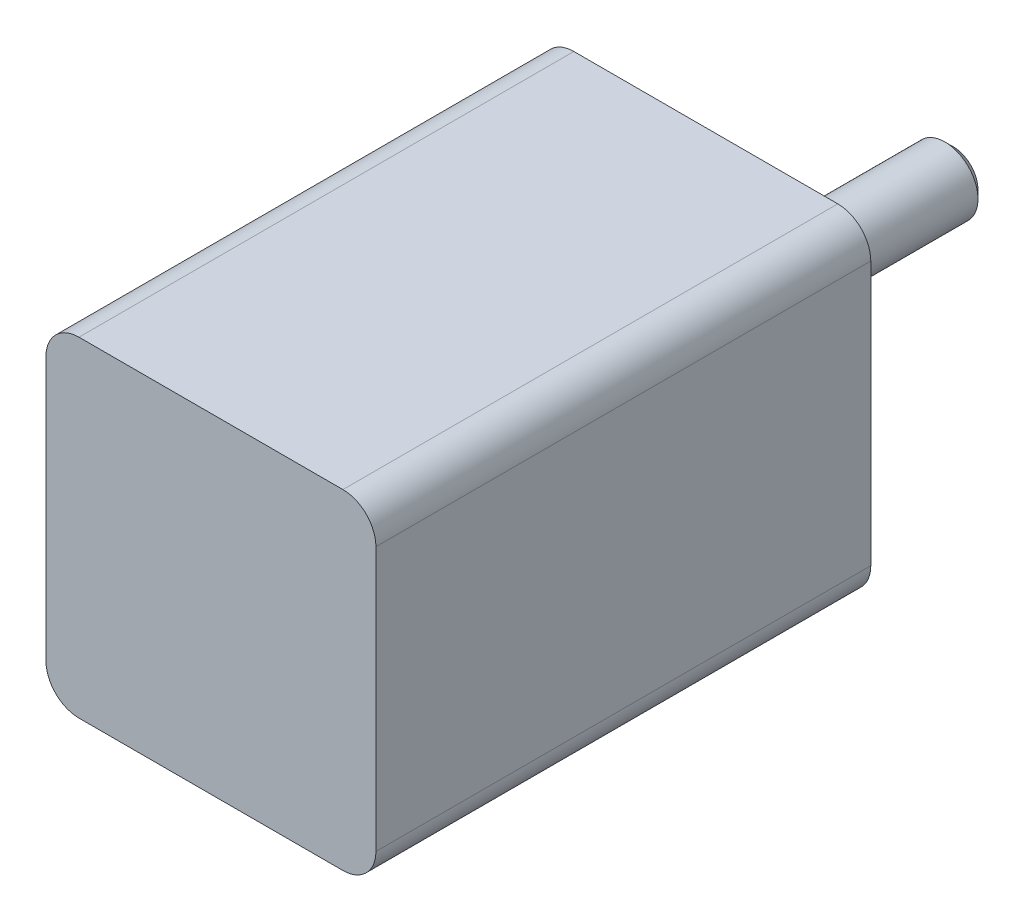
ISO-10303-21;
HEADER;
FILE_DESCRIPTION(('STEP AP214'),'2;1');
FILE_NAME('part.step','',(''),(''),'','','');
FILE_SCHEMA(('AUTOMOTIVE_DESIGN { 1 0 10303 214 1 1 1 1 }'));
ENDSEC;
DATA;
#1=APPLICATION_CONTEXT('core data for automotive mechanical design processes');
#2=APPLICATION_PROTOCOL_DEFINITION('international standard','automotive_design',2000,#1);
#3=PRODUCT_CONTEXT('',#1,'mechanical');
#4=PRODUCT('Part','Part','',(#3));
#5=PRODUCT_RELATED_PRODUCT_CATEGORY('part','',(#4));
#6=PRODUCT_DEFINITION_FORMATION('','',#4);
#7=PRODUCT_DEFINITION_CONTEXT('part definition',#1,'design');
#8=PRODUCT_DEFINITION('design','',#6,#7);
#9=PRODUCT_DEFINITION_SHAPE('','',#8);
#10=(LENGTH_UNIT() NAMED_UNIT(*) SI_UNIT(.MILLI.,.METRE.));
#11=(NAMED_UNIT(*) PLANE_ANGLE_UNIT() SI_UNIT($,.RADIAN.));
#12=(NAMED_UNIT(*) SI_UNIT($,.STERADIAN.) SOLID_ANGLE_UNIT());
#13=UNCERTAINTY_MEASURE_WITH_UNIT(LENGTH_MEASURE(1.E-05),#10,'distance_accuracy_value','');
#14=(GEOMETRIC_REPRESENTATION_CONTEXT(3) GLOBAL_UNCERTAINTY_ASSIGNED_CONTEXT((#13)) GLOBAL_UNIT_ASSIGNED_CONTEXT((#10,
#11,#12)) REPRESENTATION_CONTEXT('',''));
#15=CARTESIAN_POINT('',(0.,0.,0.));
#16=DIRECTION('',(0.,0.,1.));
#17=DIRECTION('',(1.,0.,0.));
#18=AXIS2_PLACEMENT_3D('',#15,#16,#17);
#19=CARTESIAN_POINT('',(10.,10.,30.));
#20=DIRECTION('',(-1.,0.,0.));
#21=DIRECTION('',(0.,-1.,0.));
#22=AXIS2_PLACEMENT_3D('',#19,#20,#21);
#23=PLANE('',#22);
#24=DIRECTION('',(0.,1.,0.));
#25=VECTOR('',#24,1.);
#26=CARTESIAN_POINT('',(10.,10.,30.));
#27=LINE('',#26,#25);
#28=CARTESIAN_POINT('',(10.,-8.,30.));
#29=VERTEX_POINT('',#28);
#30=CARTESIAN_POINT('',(10.,8.,30.));
#31=VERTEX_POINT('',#30);
#32=EDGE_CURVE('E156',#29,#31,#27,.T.);
#33=ORIENTED_EDGE('',*,*,#32,.F.);
#34=DIRECTION('',(0.,0.,-1.));
#35=VECTOR('',#34,1.);
#36=CARTESIAN_POINT('',(10.,-8.,30.));
#37=LINE('',#36,#35);
#38=CARTESIAN_POINT('',(10.,-8.,0.));
#39=VERTEX_POINT('',#38);
#40=EDGE_CURVE('E206',#29,#39,#37,.T.);
#41=ORIENTED_EDGE('',*,*,#40,.T.);
#42=DIRECTION('',(0.,1.,0.));
#43=VECTOR('',#42,1.);
#44=CARTESIAN_POINT('',(10.,10.,0.));
#45=LINE('',#44,#43);
#46=CARTESIAN_POINT('',(10.,8.,0.));
#47=VERTEX_POINT('',#46);
#48=EDGE_CURVE('E155',#39,#47,#45,.T.);
#49=ORIENTED_EDGE('',*,*,#48,.T.);
#50=DIRECTION('',(0.,0.,-1.));
#51=VECTOR('',#50,1.);
#52=CARTESIAN_POINT('',(10.,8.,30.));
#53=LINE('',#52,#51);
#54=EDGE_CURVE('E204',#47,#31,#53,.F.);
#55=ORIENTED_EDGE('',*,*,#54,.T.);
#56=EDGE_LOOP('',(#33,#41,#49,#55));
#57=FACE_BOUND('',#56,.T.);
#58=ADVANCED_FACE('F39',(#57),#23,.F.);
#59=CARTESIAN_POINT('',(-10.,10.,30.));
#60=DIRECTION('',(0.,-1.,0.));
#61=DIRECTION('',(0.,0.,-1.));
#62=AXIS2_PLACEMENT_3D('',#59,#60,#61);
#63=PLANE('',#62);
#64=DIRECTION('',(-1.,0.,0.));
#65=VECTOR('',#64,1.);
#66=CARTESIAN_POINT('',(-10.,10.,0.));
#67=LINE('',#66,#65);
#68=CARTESIAN_POINT('',(8.,10.,0.));
#69=VERTEX_POINT('',#68);
#70=CARTESIAN_POINT('',(-8.00000000000001,10.,0.));
#71=VERTEX_POINT('',#70);
#72=EDGE_CURVE('E170',#69,#71,#67,.T.);
#73=ORIENTED_EDGE('',*,*,#72,.T.);
#74=DIRECTION('',(0.,0.,-1.));
#75=VECTOR('',#74,1.);
#76=CARTESIAN_POINT('',(-8.00000000000001,10.,30.));
#77=LINE('',#76,#75);
#78=CARTESIAN_POINT('',(-8.00000000000001,10.,30.));
#79=VERTEX_POINT('',#78);
#80=EDGE_CURVE('E54',#71,#79,#77,.F.);
#81=ORIENTED_EDGE('',*,*,#80,.T.);
#82=DIRECTION('',(-1.,0.,0.));
#83=VECTOR('',#82,1.);
#84=CARTESIAN_POINT('',(-10.,10.,30.));
#85=LINE('',#84,#83);
#86=CARTESIAN_POINT('',(8.,10.,30.));
#87=VERTEX_POINT('',#86);
#88=EDGE_CURVE('E158',#87,#79,#85,.T.);
#89=ORIENTED_EDGE('',*,*,#88,.F.);
#90=DIRECTION('',(0.,0.,-1.));
#91=VECTOR('',#90,1.);
#92=CARTESIAN_POINT('',(8.,10.,30.));
#93=LINE('',#92,#91);
#94=EDGE_CURVE('E209',#87,#69,#93,.T.);
#95=ORIENTED_EDGE('',*,*,#94,.T.);
#96=EDGE_LOOP('',(#73,#81,#89,#95));
#97=FACE_BOUND('',#96,.T.);
#98=ADVANCED_FACE('F227',(#97),#63,.F.);
#99=CARTESIAN_POINT('',(-10.,10.,30.));
#100=DIRECTION('',(1.,0.,0.));
#101=DIRECTION('',(0.,1.,0.));
#102=AXIS2_PLACEMENT_3D('',#99,#100,#101);
#103=PLANE('',#102);
#104=DIRECTION('',(0.,-1.,0.));
#105=VECTOR('',#104,1.);
#106=CARTESIAN_POINT('',(-10.,10.,0.));
#107=LINE('',#106,#105);
#108=CARTESIAN_POINT('',(-10.,8.,0.));
#109=VERTEX_POINT('',#108);
#110=CARTESIAN_POINT('',(-10.,-8.,0.));
#111=VERTEX_POINT('',#110);
#112=EDGE_CURVE('E172',#109,#111,#107,.T.);
#113=ORIENTED_EDGE('',*,*,#112,.T.);
#114=DIRECTION('',(0.,0.,-1.));
#115=VECTOR('',#114,1.);
#116=CARTESIAN_POINT('',(-10.,-8.,30.));
#117=LINE('',#116,#115);
#118=CARTESIAN_POINT('',(-10.,-8.,30.));
#119=VERTEX_POINT('',#118);
#120=EDGE_CURVE('E195',#111,#119,#117,.F.);
#121=ORIENTED_EDGE('',*,*,#120,.T.);
#122=DIRECTION('',(0.,-1.,0.));
#123=VECTOR('',#122,1.);
#124=CARTESIAN_POINT('',(-10.,10.,30.));
#125=LINE('',#124,#123);
#126=CARTESIAN_POINT('',(-10.,8.,30.));
#127=VERTEX_POINT('',#126);
#128=EDGE_CURVE('E161',#127,#119,#125,.T.);
#129=ORIENTED_EDGE('',*,*,#128,.F.);
#130=DIRECTION('',(0.,0.,-1.));
#131=VECTOR('',#130,1.);
#132=CARTESIAN_POINT('',(-10.,8.,30.));
#133=LINE('',#132,#131);
#134=EDGE_CURVE('E192',#127,#109,#133,.T.);
#135=ORIENTED_EDGE('',*,*,#134,.T.);
#136=EDGE_LOOP('',(#113,#121,#129,#135));
#137=FACE_BOUND('',#136,.T.);
#138=ADVANCED_FACE('F233',(#137),#103,.F.);
#139=CARTESIAN_POINT('',(-10.,-10.,30.));
#140=DIRECTION('',(0.,1.,0.));
#141=DIRECTION('',(0.,0.,1.));
#142=AXIS2_PLACEMENT_3D('',#139,#140,#141);
#143=PLANE('',#142);
#144=DIRECTION('',(1.,0.,0.));
#145=VECTOR('',#144,1.);
#146=CARTESIAN_POINT('',(-10.,-10.,30.));
#147=LINE('',#146,#145);
#148=CARTESIAN_POINT('',(-8.,-10.,30.));
#149=VERTEX_POINT('',#148);
#150=CARTESIAN_POINT('',(8.,-10.,30.));
#151=VERTEX_POINT('',#150);
#152=EDGE_CURVE('E164',#149,#151,#147,.T.);
#153=ORIENTED_EDGE('',*,*,#152,.F.);
#154=DIRECTION('',(0.,0.,-1.));
#155=VECTOR('',#154,1.);
#156=CARTESIAN_POINT('',(-8.,-10.,30.));
#157=LINE('',#156,#155);
#158=CARTESIAN_POINT('',(-8.,-10.,0.));
#159=VERTEX_POINT('',#158);
#160=EDGE_CURVE('E181',#149,#159,#157,.T.);
#161=ORIENTED_EDGE('',*,*,#160,.T.);
#162=DIRECTION('',(1.,0.,0.));
#163=VECTOR('',#162,1.);
#164=CARTESIAN_POINT('',(-10.,-10.,0.));
#165=LINE('',#164,#163);
#166=CARTESIAN_POINT('',(8.,-10.,0.));
#167=VERTEX_POINT('',#166);
#168=EDGE_CURVE('E159',#159,#167,#165,.T.);
#169=ORIENTED_EDGE('',*,*,#168,.T.);
#170=DIRECTION('',(0.,0.,-1.));
#171=VECTOR('',#170,1.);
#172=CARTESIAN_POINT('',(8.,-10.,30.));
#173=LINE('',#172,#171);
#174=EDGE_CURVE('E179',#167,#151,#173,.F.);
#175=ORIENTED_EDGE('',*,*,#174,.T.);
#176=EDGE_LOOP('',(#153,#161,#169,#175));
#177=FACE_BOUND('',#176,.T.);
#178=ADVANCED_FACE('F262',(#177),#143,.F.);
#179=CARTESIAN_POINT('',(0.,0.,30.));
#180=DIRECTION('',(0.,0.,1.));
#181=DIRECTION('',(1.,0.,0.));
#182=AXIS2_PLACEMENT_3D('',#179,#180,#181);
#183=PLANE('',#182);
#184=ORIENTED_EDGE('',*,*,#128,.T.);
#185=CARTESIAN_POINT('',(-8.,-8.,30.));
#186=DIRECTION('',(0.,0.,1.));
#187=DIRECTION('',(1.,0.,0.));
#188=AXIS2_PLACEMENT_3D('',#185,#186,#187);
#189=CIRCLE('',#188,2.);
#190=EDGE_CURVE('E202',#119,#149,#189,.T.);
#191=ORIENTED_EDGE('',*,*,#190,.T.);
#192=ORIENTED_EDGE('',*,*,#152,.T.);
#193=CARTESIAN_POINT('',(8.,-8.,30.));
#194=DIRECTION('',(0.,0.,1.));
#195=DIRECTION('',(1.,0.,0.));
#196=AXIS2_PLACEMENT_3D('',#193,#194,#195);
#197=CIRCLE('',#196,2.);
#198=EDGE_CURVE('E200',#151,#29,#197,.T.);
#199=ORIENTED_EDGE('',*,*,#198,.T.);
#200=ORIENTED_EDGE('',*,*,#32,.T.);
#201=CARTESIAN_POINT('',(8.,8.,30.));
#202=DIRECTION('',(0.,0.,1.));
#203=DIRECTION('',(1.,0.,0.));
#204=AXIS2_PLACEMENT_3D('',#201,#202,#203);
#205=CIRCLE('',#204,2.);
#206=EDGE_CURVE('E61',#31,#87,#205,.T.);
#207=ORIENTED_EDGE('',*,*,#206,.T.);
#208=ORIENTED_EDGE('',*,*,#88,.T.);
#209=CARTESIAN_POINT('',(-8.00000000000001,8.,30.));
#210=DIRECTION('',(0.,0.,1.));
#211=DIRECTION('',(1.,0.,0.));
#212=AXIS2_PLACEMENT_3D('',#209,#210,#211);
#213=CIRCLE('',#212,2.);
#214=EDGE_CURVE('E198',#79,#127,#213,.T.);
#215=ORIENTED_EDGE('',*,*,#214,.T.);
#216=EDGE_LOOP('',(#184,#191,#192,#199,#200,#207,#208,#215));
#217=FACE_BOUND('',#216,.T.);
#218=ADVANCED_FACE('F253',(#217),#183,.T.);
#219=CARTESIAN_POINT('',(0.,0.,0.));
#220=DIRECTION('',(0.,0.,1.));
#221=DIRECTION('',(1.,0.,0.));
#222=AXIS2_PLACEMENT_3D('',#219,#220,#221);
#223=PLANE('',#222);
#224=CARTESIAN_POINT('',(8.,8.,0.));
#225=DIRECTION('',(0.,0.,-1.));
#226=DIRECTION('',(-1.,0.,0.));
#227=AXIS2_PLACEMENT_3D('',#224,#225,#226);
#228=CIRCLE('',#227,0.79999999999999);
#229=CARTESIAN_POINT('',(7.20000000000001,8.,0.));
#230=VERTEX_POINT('',#229);
#231=EDGE_CURVE('E127',#230,#230,#228,.T.);
#232=ORIENTED_EDGE('',*,*,#231,.F.);
#233=EDGE_LOOP('',(#232));
#234=FACE_BOUND('',#233,.T.);
#235=CARTESIAN_POINT('',(-8.,8.,0.));
#236=DIRECTION('',(0.,0.,-1.));
#237=DIRECTION('',(-1.,0.,0.));
#238=AXIS2_PLACEMENT_3D('',#235,#236,#237);
#239=CIRCLE('',#238,0.79999999999999);
#240=CARTESIAN_POINT('',(-8.79999999999999,8.,0.));
#241=VERTEX_POINT('',#240);
#242=EDGE_CURVE('E126',#241,#241,#239,.T.);
#243=ORIENTED_EDGE('',*,*,#242,.F.);
#244=EDGE_LOOP('',(#243));
#245=FACE_BOUND('',#244,.T.);
#246=CARTESIAN_POINT('',(-8.,-8.,0.));
#247=DIRECTION('',(0.,0.,-1.));
#248=DIRECTION('',(-1.,0.,0.));
#249=AXIS2_PLACEMENT_3D('',#246,#247,#248);
#250=CIRCLE('',#249,0.79999999999999);
#251=CARTESIAN_POINT('',(-8.79999999999999,-8.,0.));
#252=VERTEX_POINT('',#251);
#253=EDGE_CURVE('E137',#252,#252,#250,.T.);
#254=ORIENTED_EDGE('',*,*,#253,.F.);
#255=EDGE_LOOP('',(#254));
#256=FACE_BOUND('',#255,.T.);
#257=CARTESIAN_POINT('',(8.,-8.,0.));
#258=DIRECTION('',(0.,0.,-1.));
#259=DIRECTION('',(-1.,0.,0.));
#260=AXIS2_PLACEMENT_3D('',#257,#258,#259);
#261=CIRCLE('',#260,0.79999999999999);
#262=CARTESIAN_POINT('',(7.20000000000001,-8.,0.));
#263=VERTEX_POINT('',#262);
#264=EDGE_CURVE('E143',#263,#263,#261,.T.);
#265=ORIENTED_EDGE('',*,*,#264,.F.);
#266=EDGE_LOOP('',(#265));
#267=FACE_BOUND('',#266,.T.);
#268=CARTESIAN_POINT('',(0.,0.,0.));
#269=DIRECTION('',(0.,0.,1.));
#270=DIRECTION('',(1.,0.,0.));
#271=AXIS2_PLACEMENT_3D('',#268,#269,#270);
#272=CIRCLE('',#271,7.5);
#273=CARTESIAN_POINT('',(7.5,0.,0.));
#274=VERTEX_POINT('',#273);
#275=EDGE_CURVE('E167',#274,#274,#272,.F.);
#276=ORIENTED_EDGE('',*,*,#275,.F.);
#277=EDGE_LOOP('',(#276));
#278=FACE_BOUND('',#277,.T.);
#279=ORIENTED_EDGE('',*,*,#168,.F.);
#280=CARTESIAN_POINT('',(-8.,-8.,0.));
#281=DIRECTION('',(0.,0.,1.));
#282=DIRECTION('',(1.,0.,0.));
#283=AXIS2_PLACEMENT_3D('',#280,#281,#282);
#284=CIRCLE('',#283,2.);
#285=EDGE_CURVE('E190',#159,#111,#284,.F.);
#286=ORIENTED_EDGE('',*,*,#285,.T.);
#287=ORIENTED_EDGE('',*,*,#112,.F.);
#288=CARTESIAN_POINT('',(-8.00000000000001,8.,0.));
#289=DIRECTION('',(0.,0.,1.));
#290=DIRECTION('',(1.,0.,0.));
#291=AXIS2_PLACEMENT_3D('',#288,#289,#290);
#292=CIRCLE('',#291,2.);
#293=EDGE_CURVE('E186',#109,#71,#292,.F.);
#294=ORIENTED_EDGE('',*,*,#293,.T.);
#295=ORIENTED_EDGE('',*,*,#72,.F.);
#296=CARTESIAN_POINT('',(8.,8.,0.));
#297=DIRECTION('',(0.,0.,1.));
#298=DIRECTION('',(1.,0.,0.));
#299=AXIS2_PLACEMENT_3D('',#296,#297,#298);
#300=CIRCLE('',#299,2.);
#301=EDGE_CURVE('E184',#69,#47,#300,.F.);
#302=ORIENTED_EDGE('',*,*,#301,.T.);
#303=ORIENTED_EDGE('',*,*,#48,.F.);
#304=CARTESIAN_POINT('',(8.,-8.,0.));
#305=DIRECTION('',(0.,0.,1.));
#306=DIRECTION('',(1.,0.,0.));
#307=AXIS2_PLACEMENT_3D('',#304,#305,#306);
#308=CIRCLE('',#307,2.);
#309=EDGE_CURVE('E188',#39,#167,#308,.F.);
#310=ORIENTED_EDGE('',*,*,#309,.T.);
#311=EDGE_LOOP('',(#279,#286,#287,#294,#295,#302,#303,#310));
#312=FACE_BOUND('',#311,.T.);
#313=ADVANCED_FACE('F271',(#234,#245,#256,#267,#278,#312),#223,.F.);
#314=CARTESIAN_POINT('',(0.,0.,-1.5));
#315=DIRECTION('',(0.,0.,1.));
#316=DIRECTION('',(1.,0.,0.));
#317=AXIS2_PLACEMENT_3D('',#314,#315,#316);
#318=CYLINDRICAL_SURFACE('',#317,7.5);
#319=CARTESIAN_POINT('',(0.,0.,-1.5));
#320=DIRECTION('',(0.,0.,-1.));
#321=DIRECTION('',(-1.,0.,0.));
#322=AXIS2_PLACEMENT_3D('',#319,#320,#321);
#323=CIRCLE('',#322,7.5);
#324=CARTESIAN_POINT('',(-7.5,0.,-1.5));
#325=VERTEX_POINT('',#324);
#326=EDGE_CURVE('E152',#325,#325,#323,.T.);
#327=ORIENTED_EDGE('',*,*,#326,.F.);
#328=EDGE_LOOP('',(#327));
#329=FACE_BOUND('',#328,.T.);
#330=ORIENTED_EDGE('',*,*,#275,.T.);
#331=EDGE_LOOP('',(#330));
#332=FACE_BOUND('',#331,.T.);
#333=ADVANCED_FACE('F273',(#329,#332),#318,.T.);
#334=CARTESIAN_POINT('',(0.,0.,-1.5));
#335=DIRECTION('',(0.,0.,-1.));
#336=DIRECTION('',(-1.,0.,0.));
#337=AXIS2_PLACEMENT_3D('',#334,#335,#336);
#338=PLANE('',#337);
#339=CARTESIAN_POINT('',(0.,0.,-1.5));
#340=DIRECTION('',(0.,0.,-1.));
#341=DIRECTION('',(-1.,0.,0.));
#342=AXIS2_PLACEMENT_3D('',#339,#340,#341);
#343=CIRCLE('',#342,2.);
#344=CARTESIAN_POINT('',(-2.,0.,-1.5));
#345=VERTEX_POINT('',#344);
#346=EDGE_CURVE('E149',#345,#345,#343,.T.);
#347=ORIENTED_EDGE('',*,*,#346,.F.);
#348=EDGE_LOOP('',(#347));
#349=FACE_BOUND('',#348,.T.);
#350=ORIENTED_EDGE('',*,*,#326,.T.);
#351=EDGE_LOOP('',(#350));
#352=FACE_BOUND('',#351,.T.);
#353=ADVANCED_FACE('F280',(#349,#352),#338,.T.);
#354=CARTESIAN_POINT('',(0.,0.,-15.));
#355=DIRECTION('',(0.,0.,1.));
#356=DIRECTION('',(1.,0.,0.));
#357=AXIS2_PLACEMENT_3D('',#354,#355,#356);
#358=CYLINDRICAL_SURFACE('',#357,2.);
#359=CARTESIAN_POINT('',(0.,0.,-14.5));
#360=DIRECTION('',(0.,0.,-1.));
#361=DIRECTION('',(-1.,0.,0.));
#362=AXIS2_PLACEMENT_3D('',#359,#360,#361);
#363=CIRCLE('',#362,2.);
#364=CARTESIAN_POINT('',(-2.,0.,-14.5));
#365=VERTEX_POINT('',#364);
#366=EDGE_CURVE('E11',#365,#365,#363,.F.);
#367=ORIENTED_EDGE('',*,*,#366,.T.);
#368=EDGE_LOOP('',(#367));
#369=FACE_BOUND('',#368,.T.);
#370=ORIENTED_EDGE('',*,*,#346,.T.);
#371=EDGE_LOOP('',(#370));
#372=FACE_BOUND('',#371,.T.);
#373=ADVANCED_FACE('F339',(#369,#372),#358,.T.);
#374=CARTESIAN_POINT('',(0.,0.,-15.));
#375=DIRECTION('',(0.,0.,-1.));
#376=DIRECTION('',(-1.,0.,0.));
#377=AXIS2_PLACEMENT_3D('',#374,#375,#376);
#378=PLANE('',#377);
#379=CARTESIAN_POINT('',(0.,0.,-15.));
#380=DIRECTION('',(0.,0.,-1.));
#381=DIRECTION('',(-1.,0.,0.));
#382=AXIS2_PLACEMENT_3D('',#379,#380,#381);
#383=CIRCLE('',#382,1.50000000000001);
#384=CARTESIAN_POINT('',(-1.50000000000001,0.,-15.));
#385=VERTEX_POINT('',#384);
#386=EDGE_CURVE('E47',#385,#385,#383,.T.);
#387=ORIENTED_EDGE('',*,*,#386,.T.);
#388=EDGE_LOOP('',(#387));
#389=FACE_BOUND('',#388,.T.);
#390=ADVANCED_FACE('F215',(#389),#378,.T.);
#391=CARTESIAN_POINT('',(8.,-8.,3.5));
#392=DIRECTION('',(0.,0.,-1.));
#393=DIRECTION('',(-1.,0.,0.));
#394=AXIS2_PLACEMENT_3D('',#391,#392,#393);
#395=CONICAL_SURFACE('',#394,0.799999999999999,1.02974425867665);
#396=CARTESIAN_POINT('',(8.,-8.,3.98068849522205));
#397=VERTEX_POINT('',#396);
#398=VERTEX_LOOP('',#397);
#399=FACE_BOUND('',#398,.T.);
#400=CARTESIAN_POINT('',(8.,-8.,3.5));
#401=DIRECTION('',(0.,0.,-1.));
#402=DIRECTION('',(-1.,0.,0.));
#403=AXIS2_PLACEMENT_3D('',#400,#401,#402);
#404=CIRCLE('',#403,0.799999999999999);
#405=CARTESIAN_POINT('',(7.2,-8.,3.5));
#406=VERTEX_POINT('',#405);
#407=EDGE_CURVE('E146',#406,#406,#404,.T.);
#408=ORIENTED_EDGE('',*,*,#407,.T.);
#409=EDGE_LOOP('',(#408));
#410=FACE_BOUND('',#409,.T.);
#411=ADVANCED_FACE('F356',(#399,#410),#395,.F.);
#412=CARTESIAN_POINT('',(8.,-8.,0.));
#413=DIRECTION('',(0.,0.,-1.));
#414=DIRECTION('',(-1.,0.,0.));
#415=AXIS2_PLACEMENT_3D('',#412,#413,#414);
#416=CYLINDRICAL_SURFACE('',#415,0.799999999999994);
#417=ORIENTED_EDGE('',*,*,#407,.F.);
#418=EDGE_LOOP('',(#417));
#419=FACE_BOUND('',#418,.T.);
#420=ORIENTED_EDGE('',*,*,#264,.T.);
#421=EDGE_LOOP('',(#420));
#422=FACE_BOUND('',#421,.T.);
#423=ADVANCED_FACE('F367',(#419,#422),#416,.F.);
#424=CARTESIAN_POINT('',(-8.,-8.,3.5));
#425=DIRECTION('',(0.,0.,-1.));
#426=DIRECTION('',(-1.,0.,0.));
#427=AXIS2_PLACEMENT_3D('',#424,#425,#426);
#428=CONICAL_SURFACE('',#427,0.799999999999999,1.02974425867665);
#429=CARTESIAN_POINT('',(-8.,-8.,3.98068849522205));
#430=VERTEX_POINT('',#429);
#431=VERTEX_LOOP('',#430);
#432=FACE_BOUND('',#431,.T.);
#433=CARTESIAN_POINT('',(-8.,-8.,3.5));
#434=DIRECTION('',(0.,0.,-1.));
#435=DIRECTION('',(-1.,0.,0.));
#436=AXIS2_PLACEMENT_3D('',#433,#434,#435);
#437=CIRCLE('',#436,0.799999999999999);
#438=CARTESIAN_POINT('',(-8.8,-8.,3.5));
#439=VERTEX_POINT('',#438);
#440=EDGE_CURVE('E140',#439,#439,#437,.T.);
#441=ORIENTED_EDGE('',*,*,#440,.T.);
#442=EDGE_LOOP('',(#441));
#443=FACE_BOUND('',#442,.T.);
#444=ADVANCED_FACE('F372',(#432,#443),#428,.F.);
#445=CARTESIAN_POINT('',(-8.,-8.,0.));
#446=DIRECTION('',(0.,0.,-1.));
#447=DIRECTION('',(-1.,0.,0.));
#448=AXIS2_PLACEMENT_3D('',#445,#446,#447);
#449=CYLINDRICAL_SURFACE('',#448,0.799999999999994);
#450=ORIENTED_EDGE('',*,*,#440,.F.);
#451=EDGE_LOOP('',(#450));
#452=FACE_BOUND('',#451,.T.);
#453=ORIENTED_EDGE('',*,*,#253,.T.);
#454=EDGE_LOOP('',(#453));
#455=FACE_BOUND('',#454,.T.);
#456=ADVANCED_FACE('F382',(#452,#455),#449,.F.);
#457=CARTESIAN_POINT('',(-8.,8.,3.5));
#458=DIRECTION('',(0.,0.,-1.));
#459=DIRECTION('',(-1.,0.,0.));
#460=AXIS2_PLACEMENT_3D('',#457,#458,#459);
#461=CONICAL_SURFACE('',#460,0.799999999999999,1.02974425867665);
#462=CARTESIAN_POINT('',(-8.,8.,3.98068849522205));
#463=VERTEX_POINT('',#462);
#464=VERTEX_LOOP('',#463);
#465=FACE_BOUND('',#464,.T.);
#466=CARTESIAN_POINT('',(-8.,8.,3.5));
#467=DIRECTION('',(0.,0.,-1.));
#468=DIRECTION('',(-1.,0.,0.));
#469=AXIS2_PLACEMENT_3D('',#466,#467,#468);
#470=CIRCLE('',#469,0.799999999999999);
#471=CARTESIAN_POINT('',(-8.8,8.,3.5));
#472=VERTEX_POINT('',#471);
#473=EDGE_CURVE('E130',#472,#472,#470,.T.);
#474=ORIENTED_EDGE('',*,*,#473,.T.);
#475=EDGE_LOOP('',(#474));
#476=FACE_BOUND('',#475,.T.);
#477=ADVANCED_FACE('F387',(#465,#476),#461,.F.);
#478=CARTESIAN_POINT('',(-8.,8.,0.));
#479=DIRECTION('',(0.,0.,-1.));
#480=DIRECTION('',(-1.,0.,0.));
#481=AXIS2_PLACEMENT_3D('',#478,#479,#480);
#482=CYLINDRICAL_SURFACE('',#481,0.799999999999994);
#483=ORIENTED_EDGE('',*,*,#473,.F.);
#484=EDGE_LOOP('',(#483));
#485=FACE_BOUND('',#484,.T.);
#486=ORIENTED_EDGE('',*,*,#242,.T.);
#487=EDGE_LOOP('',(#486));
#488=FACE_BOUND('',#487,.T.);
#489=ADVANCED_FACE('F120',(#485,#488),#482,.F.);
#490=CARTESIAN_POINT('',(8.,8.,3.5));
#491=DIRECTION('',(0.,0.,-1.));
#492=DIRECTION('',(-1.,0.,0.));
#493=AXIS2_PLACEMENT_3D('',#490,#491,#492);
#494=CONICAL_SURFACE('',#493,0.799999999999999,1.02974425867665);
#495=CARTESIAN_POINT('',(8.,8.,3.98068849522205));
#496=VERTEX_POINT('',#495);
#497=VERTEX_LOOP('',#496);
#498=FACE_BOUND('',#497,.T.);
#499=CARTESIAN_POINT('',(8.,8.,3.5));
#500=DIRECTION('',(0.,0.,-1.));
#501=DIRECTION('',(-1.,0.,0.));
#502=AXIS2_PLACEMENT_3D('',#499,#500,#501);
#503=CIRCLE('',#502,0.799999999999999);
#504=CARTESIAN_POINT('',(7.2,8.,3.5));
#505=VERTEX_POINT('',#504);
#506=EDGE_CURVE('E124',#505,#505,#503,.T.);
#507=ORIENTED_EDGE('',*,*,#506,.T.);
#508=EDGE_LOOP('',(#507));
#509=FACE_BOUND('',#508,.T.);
#510=ADVANCED_FACE('F116',(#498,#509),#494,.F.);
#511=CARTESIAN_POINT('',(8.,8.,0.));
#512=DIRECTION('',(0.,0.,-1.));
#513=DIRECTION('',(-1.,0.,0.));
#514=AXIS2_PLACEMENT_3D('',#511,#512,#513);
#515=CYLINDRICAL_SURFACE('',#514,0.799999999999994);
#516=ORIENTED_EDGE('',*,*,#506,.F.);
#517=EDGE_LOOP('',(#516));
#518=FACE_BOUND('',#517,.T.);
#519=ORIENTED_EDGE('',*,*,#231,.T.);
#520=EDGE_LOOP('',(#519));
#521=FACE_BOUND('',#520,.T.);
#522=ADVANCED_FACE('F119',(#518,#521),#515,.F.);
#523=CARTESIAN_POINT('',(-8.,-8.,30.));
#524=DIRECTION('',(0.,0.,-1.));
#525=DIRECTION('',(-1.,0.,0.));
#526=AXIS2_PLACEMENT_3D('',#523,#524,#525);
#527=CYLINDRICAL_SURFACE('',#526,2.);
#528=ORIENTED_EDGE('',*,*,#190,.F.);
#529=ORIENTED_EDGE('',*,*,#120,.F.);
#530=ORIENTED_EDGE('',*,*,#285,.F.);
#531=ORIENTED_EDGE('',*,*,#160,.F.);
#532=EDGE_LOOP('',(#528,#529,#530,#531));
#533=FACE_BOUND('',#532,.T.);
#534=ADVANCED_FACE('F238',(#533),#527,.T.);
#535=CARTESIAN_POINT('',(8.,-8.,30.));
#536=DIRECTION('',(0.,0.,-1.));
#537=DIRECTION('',(-1.,0.,0.));
#538=AXIS2_PLACEMENT_3D('',#535,#536,#537);
#539=CYLINDRICAL_SURFACE('',#538,2.);
#540=ORIENTED_EDGE('',*,*,#198,.F.);
#541=ORIENTED_EDGE('',*,*,#174,.F.);
#542=ORIENTED_EDGE('',*,*,#309,.F.);
#543=ORIENTED_EDGE('',*,*,#40,.F.);
#544=EDGE_LOOP('',(#540,#541,#542,#543));
#545=FACE_BOUND('',#544,.T.);
#546=ADVANCED_FACE('F241',(#545),#539,.T.);
#547=CARTESIAN_POINT('',(-8.00000000000001,8.,30.));
#548=DIRECTION('',(0.,0.,-1.));
#549=DIRECTION('',(-1.,0.,0.));
#550=AXIS2_PLACEMENT_3D('',#547,#548,#549);
#551=CYLINDRICAL_SURFACE('',#550,2.);
#552=ORIENTED_EDGE('',*,*,#214,.F.);
#553=ORIENTED_EDGE('',*,*,#80,.F.);
#554=ORIENTED_EDGE('',*,*,#293,.F.);
#555=ORIENTED_EDGE('',*,*,#134,.F.);
#556=EDGE_LOOP('',(#552,#553,#554,#555));
#557=FACE_BOUND('',#556,.T.);
#558=ADVANCED_FACE('F223',(#557),#551,.T.);
#559=CARTESIAN_POINT('',(8.,8.,30.));
#560=DIRECTION('',(0.,0.,-1.));
#561=DIRECTION('',(-1.,0.,0.));
#562=AXIS2_PLACEMENT_3D('',#559,#560,#561);
#563=CYLINDRICAL_SURFACE('',#562,2.);
#564=ORIENTED_EDGE('',*,*,#206,.F.);
#565=ORIENTED_EDGE('',*,*,#54,.F.);
#566=ORIENTED_EDGE('',*,*,#301,.F.);
#567=ORIENTED_EDGE('',*,*,#94,.F.);
#568=EDGE_LOOP('',(#564,#565,#566,#567));
#569=FACE_BOUND('',#568,.T.);
#570=ADVANCED_FACE('F218',(#569),#563,.T.);
#571=CARTESIAN_POINT('',(0.,0.,-15.));
#572=DIRECTION('',(0.,0.,1.));
#573=DIRECTION('',(1.,0.,0.));
#574=AXIS2_PLACEMENT_3D('',#571,#572,#573);
#575=CONICAL_SURFACE('',#574,1.50000000000001,0.785398163397448);
#576=ORIENTED_EDGE('',*,*,#366,.F.);
#577=EDGE_LOOP('',(#576));
#578=FACE_BOUND('',#577,.T.);
#579=ORIENTED_EDGE('',*,*,#386,.F.);
#580=EDGE_LOOP('',(#579));
#581=FACE_BOUND('',#580,.T.);
#582=ADVANCED_FACE('F41',(#578,#581),#575,.T.);
#583=CLOSED_SHELL('',(#58,#98,#138,#178,#218,#313,#333,#353,#373,#390,#411,#423,#444,#456,#477,
#489,#510,#522,#534,#546,#558,#570,#582));
#584=MANIFOLD_SOLID_BREP('B2',#583);
#585=ADVANCED_BREP_SHAPE_REPRESENTATION('',(#18,#584),#14);
#586=SHAPE_DEFINITION_REPRESENTATION(#9,#585);
ENDSEC;
END-ISO-10303-21;
